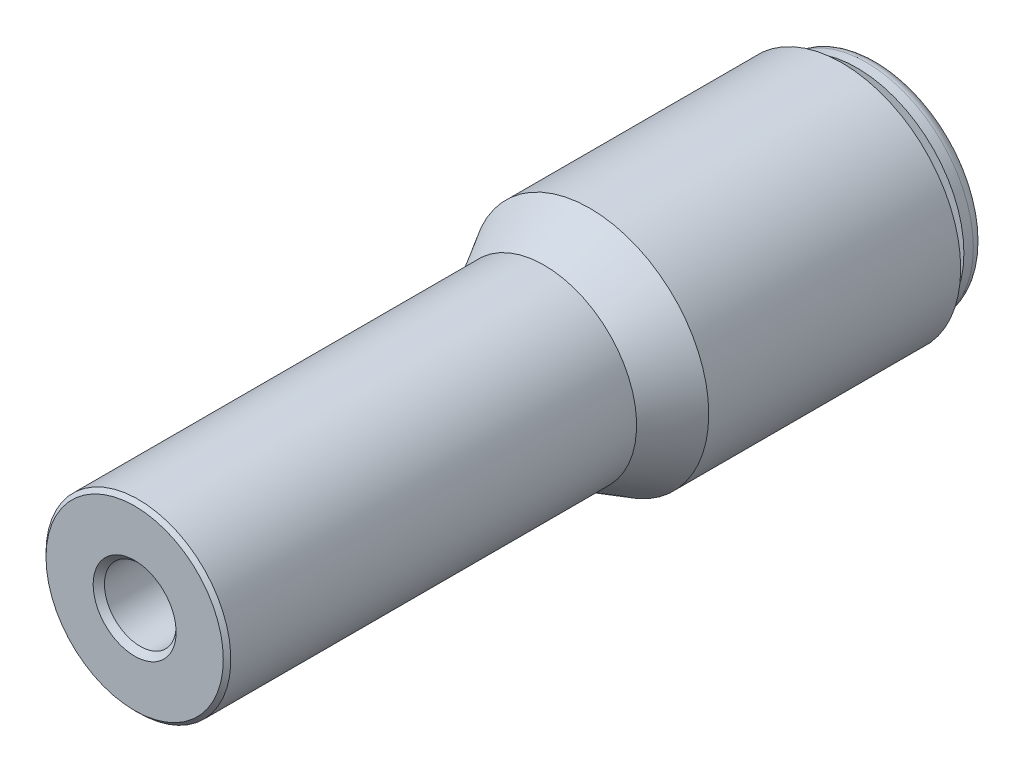
ISO-10303-21;
HEADER;
FILE_DESCRIPTION(('STEP AP214'),'2;1');
FILE_NAME('part.step','',(''),(''),'','','');
FILE_SCHEMA(('AUTOMOTIVE_DESIGN { 1 0 10303 214 1 1 1 1 }'));
ENDSEC;
DATA;
#1=APPLICATION_CONTEXT('core data for automotive mechanical design processes');
#2=APPLICATION_PROTOCOL_DEFINITION('international standard','automotive_design',2000,#1);
#3=PRODUCT_CONTEXT('',#1,'mechanical');
#4=PRODUCT('Part','Part','',(#3));
#5=PRODUCT_RELATED_PRODUCT_CATEGORY('part','',(#4));
#6=PRODUCT_DEFINITION_FORMATION('','',#4);
#7=PRODUCT_DEFINITION_CONTEXT('part definition',#1,'design');
#8=PRODUCT_DEFINITION('design','',#6,#7);
#9=PRODUCT_DEFINITION_SHAPE('','',#8);
#10=(LENGTH_UNIT() NAMED_UNIT(*) SI_UNIT(.MILLI.,.METRE.));
#11=(NAMED_UNIT(*) PLANE_ANGLE_UNIT() SI_UNIT($,.RADIAN.));
#12=(NAMED_UNIT(*) SI_UNIT($,.STERADIAN.) SOLID_ANGLE_UNIT());
#13=UNCERTAINTY_MEASURE_WITH_UNIT(LENGTH_MEASURE(1.E-05),#10,'distance_accuracy_value','');
#14=(GEOMETRIC_REPRESENTATION_CONTEXT(3) GLOBAL_UNCERTAINTY_ASSIGNED_CONTEXT((#13)) GLOBAL_UNIT_ASSIGNED_CONTEXT((#10,
#11,#12)) REPRESENTATION_CONTEXT('',''));
#15=CARTESIAN_POINT('',(0.,0.,0.));
#16=DIRECTION('',(0.,0.,1.));
#17=DIRECTION('',(1.,0.,0.));
#18=AXIS2_PLACEMENT_3D('',#15,#16,#17);
#19=CARTESIAN_POINT('',(0.,0.,25.019));
#20=DIRECTION('',(0.,0.,-1.));
#21=DIRECTION('',(-1.,0.,0.));
#22=AXIS2_PLACEMENT_3D('',#19,#20,#21);
#23=CONICAL_SURFACE('',#22,5.96900000000002,0.785398163397446);
#24=CARTESIAN_POINT('',(0.,0.,25.019));
#25=DIRECTION('',(0.,0.,-1.));
#26=DIRECTION('',(-1.,0.,0.));
#27=AXIS2_PLACEMENT_3D('',#24,#25,#26);
#28=CIRCLE('',#27,5.96900000000002);
#29=CARTESIAN_POINT('',(-5.96900000000002,0.,25.019));
#30=VERTEX_POINT('',#29);
#31=EDGE_CURVE('E39',#30,#30,#28,.F.);
#32=ORIENTED_EDGE('',*,*,#31,.F.);
#33=EDGE_LOOP('',(#32));
#34=FACE_BOUND('',#33,.T.);
#35=CARTESIAN_POINT('',(0.,0.,24.765));
#36=DIRECTION('',(0.,0.,-1.));
#37=DIRECTION('',(-1.,0.,0.));
#38=AXIS2_PLACEMENT_3D('',#35,#36,#37);
#39=CIRCLE('',#38,6.223);
#40=CARTESIAN_POINT('',(-6.223,0.,24.765));
#41=VERTEX_POINT('',#40);
#42=EDGE_CURVE('E35',#41,#41,#39,.F.);
#43=ORIENTED_EDGE('',*,*,#42,.T.);
#44=EDGE_LOOP('',(#43));
#45=FACE_BOUND('',#44,.T.);
#46=ADVANCED_FACE('F31',(#34,#45),#23,.T.);
#47=CARTESIAN_POINT('',(0.,0.,-5.6395047721851));
#48=DIRECTION('',(0.,0.,-1.));
#49=DIRECTION('',(-1.,0.,0.));
#50=AXIS2_PLACEMENT_3D('',#47,#48,#49);
#51=CONICAL_SURFACE('',#50,8.001,0.5235987755983);
#52=CARTESIAN_POINT('',(0.,0.,-5.6395047721851));
#53=DIRECTION('',(0.,0.,1.));
#54=DIRECTION('',(1.,0.,0.));
#55=AXIS2_PLACEMENT_3D('',#52,#53,#54);
#56=CIRCLE('',#55,8.001);
#57=CARTESIAN_POINT('',(8.001,0.,-5.6395047721851));
#58=VERTEX_POINT('',#57);
#59=EDGE_CURVE('E48',#58,#58,#56,.T.);
#60=ORIENTED_EDGE('',*,*,#59,.T.);
#61=EDGE_LOOP('',(#60));
#62=FACE_BOUND('',#61,.T.);
#63=CARTESIAN_POINT('',(0.,0.,-2.55991843632764));
#64=DIRECTION('',(0.,0.,-1.));
#65=DIRECTION('',(-1.,0.,0.));
#66=AXIS2_PLACEMENT_3D('',#63,#64,#65);
#67=CIRCLE('',#66,6.223);
#68=CARTESIAN_POINT('',(-6.223,0.,-2.55991843632764));
#69=VERTEX_POINT('',#68);
#70=EDGE_CURVE('E81',#69,#69,#67,.F.);
#71=ORIENTED_EDGE('',*,*,#70,.F.);
#72=EDGE_LOOP('',(#71));
#73=FACE_BOUND('',#72,.T.);
#74=ADVANCED_FACE('F100',(#62,#73),#51,.T.);
#75=CARTESIAN_POINT('',(0.,0.,0.));
#76=DIRECTION('',(0.,0.,1.));
#77=DIRECTION('',(1.,0.,0.));
#78=AXIS2_PLACEMENT_3D('',#75,#76,#77);
#79=CYLINDRICAL_SURFACE('',#78,8.001);
#80=ORIENTED_EDGE('',*,*,#59,.F.);
#81=EDGE_LOOP('',(#80));
#82=FACE_BOUND('',#81,.T.);
#83=CARTESIAN_POINT('',(0.,0.,-22.606));
#84=DIRECTION('',(0.,0.,1.));
#85=DIRECTION('',(1.,0.,0.));
#86=AXIS2_PLACEMENT_3D('',#83,#84,#85);
#87=CIRCLE('',#86,8.001);
#88=CARTESIAN_POINT('',(8.001,0.,-22.606));
#89=VERTEX_POINT('',#88);
#90=EDGE_CURVE('E51',#89,#89,#87,.T.);
#91=ORIENTED_EDGE('',*,*,#90,.T.);
#92=EDGE_LOOP('',(#91));
#93=FACE_BOUND('',#92,.T.);
#94=ADVANCED_FACE('F106',(#82,#93),#79,.T.);
#95=CARTESIAN_POINT('',(0.,8.001,-22.606));
#96=DIRECTION('',(0.,0.,1.));
#97=DIRECTION('',(1.,0.,0.));
#98=AXIS2_PLACEMENT_3D('',#95,#96,#97);
#99=PLANE('',#98);
#100=ORIENTED_EDGE('',*,*,#90,.F.);
#101=EDGE_LOOP('',(#100));
#102=FACE_BOUND('',#101,.T.);
#103=CARTESIAN_POINT('',(0.,0.,-22.606));
#104=DIRECTION('',(0.,0.,1.));
#105=DIRECTION('',(1.,0.,0.));
#106=AXIS2_PLACEMENT_3D('',#103,#104,#105);
#107=CIRCLE('',#106,6.48081);
#108=CARTESIAN_POINT('',(6.48081,0.,-22.606));
#109=VERTEX_POINT('',#108);
#110=EDGE_CURVE('E54',#109,#109,#107,.T.);
#111=ORIENTED_EDGE('',*,*,#110,.T.);
#112=EDGE_LOOP('',(#111));
#113=FACE_BOUND('',#112,.T.);
#114=ADVANCED_FACE('F113',(#102,#113),#99,.F.);
#115=CARTESIAN_POINT('',(0.,0.,0.));
#116=DIRECTION('',(0.,0.,1.));
#117=DIRECTION('',(1.,0.,0.));
#118=AXIS2_PLACEMENT_3D('',#115,#116,#117);
#119=CYLINDRICAL_SURFACE('',#118,6.48081);
#120=ORIENTED_EDGE('',*,*,#110,.F.);
#121=EDGE_LOOP('',(#120));
#122=FACE_BOUND('',#121,.T.);
#123=CARTESIAN_POINT('',(0.,0.,-23.622));
#124=DIRECTION('',(0.,0.,1.));
#125=DIRECTION('',(1.,0.,0.));
#126=AXIS2_PLACEMENT_3D('',#123,#124,#125);
#127=CIRCLE('',#126,6.48081);
#128=CARTESIAN_POINT('',(6.48081,0.,-23.622));
#129=VERTEX_POINT('',#128);
#130=EDGE_CURVE('E57',#129,#129,#127,.T.);
#131=ORIENTED_EDGE('',*,*,#130,.T.);
#132=EDGE_LOOP('',(#131));
#133=FACE_BOUND('',#132,.T.);
#134=ADVANCED_FACE('F117',(#122,#133),#119,.T.);
#135=CARTESIAN_POINT('',(0.,7.2009,-23.622));
#136=DIRECTION('',(0.,0.,-1.));
#137=DIRECTION('',(-1.,0.,0.));
#138=AXIS2_PLACEMENT_3D('',#135,#136,#137);
#139=PLANE('',#138);
#140=ORIENTED_EDGE('',*,*,#130,.F.);
#141=EDGE_LOOP('',(#140));
#142=FACE_BOUND('',#141,.T.);
#143=CARTESIAN_POINT('',(0.,0.,-23.622));
#144=DIRECTION('',(0.,0.,1.));
#145=DIRECTION('',(1.,0.,0.));
#146=AXIS2_PLACEMENT_3D('',#143,#144,#145);
#147=CIRCLE('',#146,7.2009);
#148=CARTESIAN_POINT('',(7.2009,0.,-23.622));
#149=VERTEX_POINT('',#148);
#150=EDGE_CURVE('E60',#149,#149,#147,.T.);
#151=ORIENTED_EDGE('',*,*,#150,.T.);
#152=EDGE_LOOP('',(#151));
#153=FACE_BOUND('',#152,.T.);
#154=ADVANCED_FACE('F121',(#142,#153),#139,.F.);
#155=CARTESIAN_POINT('',(0.,0.,0.));
#156=DIRECTION('',(0.,0.,1.));
#157=DIRECTION('',(1.,0.,0.));
#158=AXIS2_PLACEMENT_3D('',#155,#156,#157);
#159=CYLINDRICAL_SURFACE('',#158,7.2009);
#160=ORIENTED_EDGE('',*,*,#150,.F.);
#161=EDGE_LOOP('',(#160));
#162=FACE_BOUND('',#161,.T.);
#163=CARTESIAN_POINT('',(0.,0.,-24.257));
#164=DIRECTION('',(0.,0.,1.));
#165=DIRECTION('',(1.,0.,0.));
#166=AXIS2_PLACEMENT_3D('',#163,#164,#165);
#167=CIRCLE('',#166,7.2009);
#168=CARTESIAN_POINT('',(7.2009,0.,-24.257));
#169=VERTEX_POINT('',#168);
#170=EDGE_CURVE('E63',#169,#169,#167,.T.);
#171=ORIENTED_EDGE('',*,*,#170,.T.);
#172=EDGE_LOOP('',(#171));
#173=FACE_BOUND('',#172,.T.);
#174=ADVANCED_FACE('F125',(#162,#173),#159,.T.);
#175=CARTESIAN_POINT('',(0.,0.,-24.257));
#176=DIRECTION('',(0.,0.,1.));
#177=DIRECTION('',(1.,0.,0.));
#178=AXIS2_PLACEMENT_3D('',#175,#176,#177);
#179=TOROIDAL_SURFACE('',#178,6.4389,0.762);
#180=ORIENTED_EDGE('',*,*,#170,.F.);
#181=EDGE_LOOP('',(#180));
#182=FACE_BOUND('',#181,.T.);
#183=CARTESIAN_POINT('',(0.,0.,-25.019));
#184=DIRECTION('',(0.,0.,1.));
#185=DIRECTION('',(1.,0.,0.));
#186=AXIS2_PLACEMENT_3D('',#183,#184,#185);
#187=CIRCLE('',#186,6.4389);
#188=CARTESIAN_POINT('',(6.4389,0.,-25.019));
#189=VERTEX_POINT('',#188);
#190=EDGE_CURVE('E66',#189,#189,#187,.T.);
#191=ORIENTED_EDGE('',*,*,#190,.T.);
#192=EDGE_LOOP('',(#191));
#193=FACE_BOUND('',#192,.T.);
#194=ADVANCED_FACE('F129',(#182,#193),#179,.T.);
#195=CARTESIAN_POINT('',(0.,6.4389,-25.019));
#196=DIRECTION('',(0.,0.,1.));
#197=DIRECTION('',(1.,0.,0.));
#198=AXIS2_PLACEMENT_3D('',#195,#196,#197);
#199=PLANE('',#198);
#200=ORIENTED_EDGE('',*,*,#190,.F.);
#201=EDGE_LOOP('',(#200));
#202=FACE_BOUND('',#201,.T.);
#203=CARTESIAN_POINT('',(0.,0.,-25.019));
#204=DIRECTION('',(0.,0.,1.));
#205=DIRECTION('',(1.,0.,0.));
#206=AXIS2_PLACEMENT_3D('',#203,#204,#205);
#207=CIRCLE('',#206,3.556);
#208=CARTESIAN_POINT('',(3.556,0.,-25.019));
#209=VERTEX_POINT('',#208);
#210=EDGE_CURVE('E69',#209,#209,#207,.T.);
#211=ORIENTED_EDGE('',*,*,#210,.T.);
#212=EDGE_LOOP('',(#211));
#213=FACE_BOUND('',#212,.T.);
#214=ADVANCED_FACE('F133',(#202,#213),#199,.F.);
#215=CARTESIAN_POINT('',(0.,0.,-24.638));
#216=DIRECTION('',(0.,0.,-1.));
#217=DIRECTION('',(-1.,0.,0.));
#218=AXIS2_PLACEMENT_3D('',#215,#216,#217);
#219=CONICAL_SURFACE('',#218,3.175,0.785398163397449);
#220=ORIENTED_EDGE('',*,*,#210,.F.);
#221=EDGE_LOOP('',(#220));
#222=FACE_BOUND('',#221,.T.);
#223=CARTESIAN_POINT('',(0.,0.,-24.638));
#224=DIRECTION('',(0.,0.,1.));
#225=DIRECTION('',(1.,0.,0.));
#226=AXIS2_PLACEMENT_3D('',#223,#224,#225);
#227=CIRCLE('',#226,3.175);
#228=CARTESIAN_POINT('',(3.175,0.,-24.638));
#229=VERTEX_POINT('',#228);
#230=EDGE_CURVE('E72',#229,#229,#227,.T.);
#231=ORIENTED_EDGE('',*,*,#230,.T.);
#232=EDGE_LOOP('',(#231));
#233=FACE_BOUND('',#232,.T.);
#234=ADVANCED_FACE('F137',(#222,#233),#219,.F.);
#235=CARTESIAN_POINT('',(0.,0.,0.));
#236=DIRECTION('',(0.,0.,1.));
#237=DIRECTION('',(1.,0.,0.));
#238=AXIS2_PLACEMENT_3D('',#235,#236,#237);
#239=CYLINDRICAL_SURFACE('',#238,3.175);
#240=ORIENTED_EDGE('',*,*,#230,.F.);
#241=EDGE_LOOP('',(#240));
#242=FACE_BOUND('',#241,.T.);
#243=CARTESIAN_POINT('',(0.,0.,-4.04988888888889));
#244=DIRECTION('',(0.,0.,1.));
#245=DIRECTION('',(1.,0.,0.));
#246=AXIS2_PLACEMENT_3D('',#243,#244,#245);
#247=CIRCLE('',#246,3.175);
#248=CARTESIAN_POINT('',(3.175,0.,-4.04988888888889));
#249=VERTEX_POINT('',#248);
#250=EDGE_CURVE('E75',#249,#249,#247,.T.);
#251=ORIENTED_EDGE('',*,*,#250,.T.);
#252=EDGE_LOOP('',(#251));
#253=FACE_BOUND('',#252,.T.);
#254=ADVANCED_FACE('F141',(#242,#253),#239,.F.);
#255=CARTESIAN_POINT('',(0.,3.175,-4.04988888888889));
#256=DIRECTION('',(0.,0.,1.));
#257=DIRECTION('',(1.,0.,0.));
#258=AXIS2_PLACEMENT_3D('',#255,#256,#257);
#259=PLANE('',#258);
#260=ORIENTED_EDGE('',*,*,#250,.F.);
#261=EDGE_LOOP('',(#260));
#262=FACE_BOUND('',#261,.T.);
#263=CARTESIAN_POINT('',(0.,0.,-4.04988888888889));
#264=DIRECTION('',(0.,0.,1.));
#265=DIRECTION('',(1.,0.,0.));
#266=AXIS2_PLACEMENT_3D('',#263,#264,#265);
#267=CIRCLE('',#266,2.413);
#268=CARTESIAN_POINT('',(2.413,0.,-4.04988888888889));
#269=VERTEX_POINT('',#268);
#270=EDGE_CURVE('E78',#269,#269,#267,.T.);
#271=ORIENTED_EDGE('',*,*,#270,.T.);
#272=EDGE_LOOP('',(#271));
#273=FACE_BOUND('',#272,.T.);
#274=ADVANCED_FACE('F145',(#262,#273),#259,.F.);
#275=CARTESIAN_POINT('',(0.,0.,0.));
#276=DIRECTION('',(0.,0.,1.));
#277=DIRECTION('',(1.,0.,0.));
#278=AXIS2_PLACEMENT_3D('',#275,#276,#277);
#279=CYLINDRICAL_SURFACE('',#278,2.413);
#280=CARTESIAN_POINT('',(0.,0.,24.638));
#281=DIRECTION('',(0.,0.,-1.));
#282=DIRECTION('',(-1.,0.,0.));
#283=AXIS2_PLACEMENT_3D('',#280,#281,#282);
#284=CIRCLE('',#283,2.413);
#285=CARTESIAN_POINT('',(-2.413,0.,24.638));
#286=VERTEX_POINT('',#285);
#287=EDGE_CURVE('E10',#286,#286,#284,.F.);
#288=ORIENTED_EDGE('',*,*,#287,.T.);
#289=EDGE_LOOP('',(#288));
#290=FACE_BOUND('',#289,.T.);
#291=ORIENTED_EDGE('',*,*,#270,.F.);
#292=EDGE_LOOP('',(#291));
#293=FACE_BOUND('',#292,.T.);
#294=ADVANCED_FACE('F149',(#290,#293),#279,.F.);
#295=CARTESIAN_POINT('',(0.,6.35,25.019));
#296=DIRECTION('',(0.,0.,-1.));
#297=DIRECTION('',(-1.,0.,0.));
#298=AXIS2_PLACEMENT_3D('',#295,#296,#297);
#299=PLANE('',#298);
#300=ORIENTED_EDGE('',*,*,#31,.T.);
#301=EDGE_LOOP('',(#300));
#302=FACE_BOUND('',#301,.T.);
#303=CARTESIAN_POINT('',(0.,0.,25.019));
#304=DIRECTION('',(0.,0.,-1.));
#305=DIRECTION('',(-1.,0.,0.));
#306=AXIS2_PLACEMENT_3D('',#303,#304,#305);
#307=CIRCLE('',#306,2.79399999999999);
#308=CARTESIAN_POINT('',(-2.79399999999999,0.,25.019));
#309=VERTEX_POINT('',#308);
#310=EDGE_CURVE('E43',#309,#309,#307,.T.);
#311=ORIENTED_EDGE('',*,*,#310,.T.);
#312=EDGE_LOOP('',(#311));
#313=FACE_BOUND('',#312,.T.);
#314=ADVANCED_FACE('F96',(#302,#313),#299,.F.);
#315=CARTESIAN_POINT('',(0.,0.,24.638));
#316=DIRECTION('',(0.,0.,1.));
#317=DIRECTION('',(1.,0.,0.));
#318=AXIS2_PLACEMENT_3D('',#315,#316,#317);
#319=CONICAL_SURFACE('',#318,2.413,0.785398163397449);
#320=ORIENTED_EDGE('',*,*,#310,.F.);
#321=EDGE_LOOP('',(#320));
#322=FACE_BOUND('',#321,.T.);
#323=ORIENTED_EDGE('',*,*,#287,.F.);
#324=EDGE_LOOP('',(#323));
#325=FACE_BOUND('',#324,.T.);
#326=ADVANCED_FACE('F33',(#322,#325),#319,.F.);
#327=CARTESIAN_POINT('',(0.,0.,-25.02));
#328=DIRECTION('',(0.,0.,1.));
#329=DIRECTION('',(1.,0.,0.));
#330=AXIS2_PLACEMENT_3D('',#327,#328,#329);
#331=CYLINDRICAL_SURFACE('',#330,6.223);
#332=ORIENTED_EDGE('',*,*,#42,.F.);
#333=EDGE_LOOP('',(#332));
#334=FACE_BOUND('',#333,.T.);
#335=ORIENTED_EDGE('',*,*,#70,.T.);
#336=EDGE_LOOP('',(#335));
#337=FACE_BOUND('',#336,.T.);
#338=ADVANCED_FACE('F89',(#334,#337),#331,.T.);
#339=CLOSED_SHELL('',(#46,#74,#94,#114,#134,#154,#174,#194,#214,#234,#254,#274,#294,#314,#326,#338));
#340=MANIFOLD_SOLID_BREP('B2',#339);
#341=ADVANCED_BREP_SHAPE_REPRESENTATION('',(#18,#340),#14);
#342=SHAPE_DEFINITION_REPRESENTATION(#9,#341);
ENDSEC;
END-ISO-10303-21;
